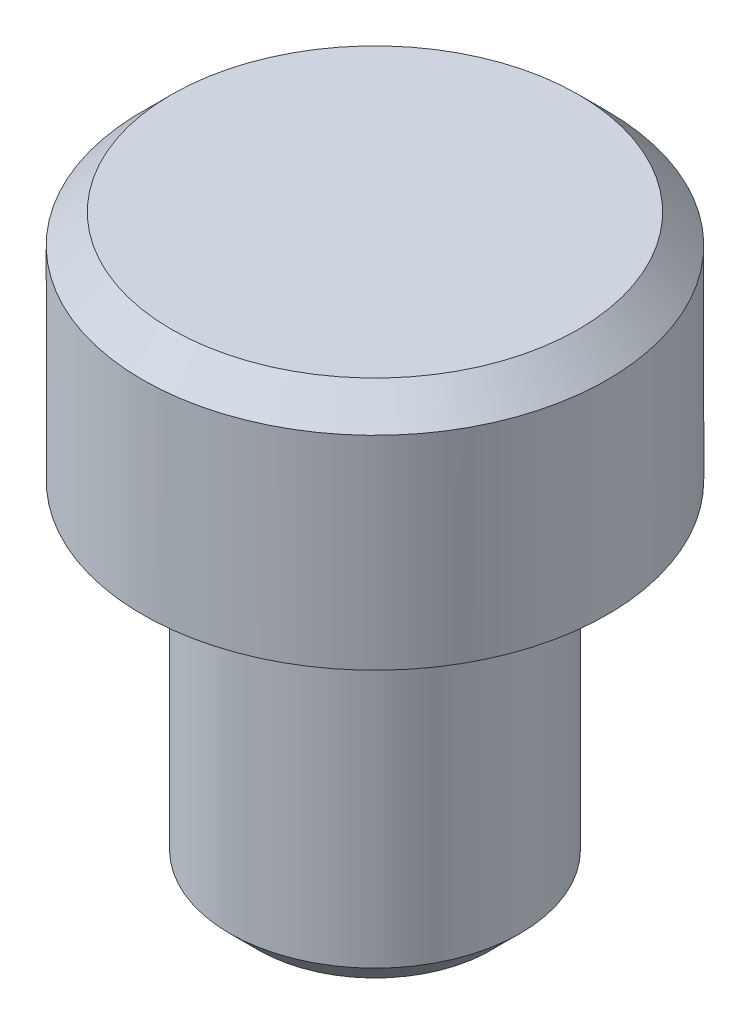
ISO-10303-21;
HEADER;
FILE_DESCRIPTION(('STEP AP214'),'2;1');
FILE_NAME('part.step','',(''),(''),'','','');
FILE_SCHEMA(('AUTOMOTIVE_DESIGN { 1 0 10303 214 1 1 1 1 }'));
ENDSEC;
DATA;
#1=APPLICATION_CONTEXT('core data for automotive mechanical design processes');
#2=APPLICATION_PROTOCOL_DEFINITION('international standard','automotive_design',2000,#1);
#3=PRODUCT_CONTEXT('',#1,'mechanical');
#4=PRODUCT('Part','Part','',(#3));
#5=PRODUCT_RELATED_PRODUCT_CATEGORY('part','',(#4));
#6=PRODUCT_DEFINITION_FORMATION('','',#4);
#7=PRODUCT_DEFINITION_CONTEXT('part definition',#1,'design');
#8=PRODUCT_DEFINITION('design','',#6,#7);
#9=PRODUCT_DEFINITION_SHAPE('','',#8);
#10=(LENGTH_UNIT() NAMED_UNIT(*) SI_UNIT(.MILLI.,.METRE.));
#11=(NAMED_UNIT(*) PLANE_ANGLE_UNIT() SI_UNIT($,.RADIAN.));
#12=(NAMED_UNIT(*) SI_UNIT($,.STERADIAN.) SOLID_ANGLE_UNIT());
#13=UNCERTAINTY_MEASURE_WITH_UNIT(LENGTH_MEASURE(1.E-05),#10,'distance_accuracy_value','');
#14=(GEOMETRIC_REPRESENTATION_CONTEXT(3) GLOBAL_UNCERTAINTY_ASSIGNED_CONTEXT((#13)) GLOBAL_UNIT_ASSIGNED_CONTEXT((#10,
#11,#12)) REPRESENTATION_CONTEXT('',''));
#15=CARTESIAN_POINT('',(0.,0.,0.));
#16=DIRECTION('',(0.,0.,1.));
#17=DIRECTION('',(1.,0.,0.));
#18=AXIS2_PLACEMENT_3D('',#15,#16,#17);
#19=CARTESIAN_POINT('',(0.,0.,0.));
#20=DIRECTION('',(0.,1.,0.));
#21=DIRECTION('',(0.,0.,1.));
#22=AXIS2_PLACEMENT_3D('',#19,#20,#21);
#23=PLANE('',#22);
#24=CARTESIAN_POINT('',(0.,0.,0.));
#25=DIRECTION('',(0.,1.,0.));
#26=DIRECTION('',(0.,0.,1.));
#27=AXIS2_PLACEMENT_3D('',#24,#25,#26);
#28=CIRCLE('',#27,6.99999999999999);
#29=CARTESIAN_POINT('',(0.,0.,6.99999999999999));
#30=VERTEX_POINT('',#29);
#31=EDGE_CURVE('E10',#30,#30,#28,.T.);
#32=ORIENTED_EDGE('',*,*,#31,.T.);
#33=EDGE_LOOP('',(#32));
#34=FACE_BOUND('',#33,.T.);
#35=ADVANCED_FACE('F32',(#34),#23,.T.);
#36=CARTESIAN_POINT('',(0.,-20.,0.));
#37=DIRECTION('',(0.,-1.,0.));
#38=DIRECTION('',(0.,0.,-1.));
#39=AXIS2_PLACEMENT_3D('',#36,#37,#38);
#40=CYLINDRICAL_SURFACE('',#39,8.);
#41=CARTESIAN_POINT('',(0.,-1.,0.));
#42=DIRECTION('',(0.,1.,0.));
#43=DIRECTION('',(0.,0.,1.));
#44=AXIS2_PLACEMENT_3D('',#41,#42,#43);
#45=CIRCLE('',#44,8.);
#46=CARTESIAN_POINT('',(0.,-1.,8.));
#47=VERTEX_POINT('',#46);
#48=EDGE_CURVE('E39',#47,#47,#45,.F.);
#49=ORIENTED_EDGE('',*,*,#48,.T.);
#50=EDGE_LOOP('',(#49));
#51=FACE_BOUND('',#50,.T.);
#52=CARTESIAN_POINT('',(0.,-8.,0.));
#53=DIRECTION('',(0.,-1.,0.));
#54=DIRECTION('',(0.,0.,-1.));
#55=AXIS2_PLACEMENT_3D('',#52,#53,#54);
#56=CIRCLE('',#55,8.);
#57=CARTESIAN_POINT('',(0.,-8.,-8.));
#58=VERTEX_POINT('',#57);
#59=EDGE_CURVE('E55',#58,#58,#56,.T.);
#60=ORIENTED_EDGE('',*,*,#59,.F.);
#61=EDGE_LOOP('',(#60));
#62=FACE_BOUND('',#61,.T.);
#63=ADVANCED_FACE('F80',(#51,#62),#40,.T.);
#64=CARTESIAN_POINT('',(8.,-8.,0.));
#65=DIRECTION('',(0.,-1.,0.));
#66=DIRECTION('',(0.,0.,-1.));
#67=AXIS2_PLACEMENT_3D('',#64,#65,#66);
#68=PLANE('',#67);
#69=ORIENTED_EDGE('',*,*,#59,.T.);
#70=EDGE_LOOP('',(#69));
#71=FACE_BOUND('',#70,.T.);
#72=CARTESIAN_POINT('',(0.,-8.,0.));
#73=DIRECTION('',(0.,-1.,0.));
#74=DIRECTION('',(0.,0.,-1.));
#75=AXIS2_PLACEMENT_3D('',#72,#73,#74);
#76=CIRCLE('',#75,4.);
#77=CARTESIAN_POINT('',(0.,-8.,-4.));
#78=VERTEX_POINT('',#77);
#79=EDGE_CURVE('E58',#78,#78,#76,.T.);
#80=ORIENTED_EDGE('',*,*,#79,.F.);
#81=EDGE_LOOP('',(#80));
#82=FACE_BOUND('',#81,.T.);
#83=ADVANCED_FACE('F70',(#71,#82),#68,.T.);
#84=CARTESIAN_POINT('',(0.,-20.,0.));
#85=DIRECTION('',(0.,-1.,0.));
#86=DIRECTION('',(0.,0.,-1.));
#87=AXIS2_PLACEMENT_3D('',#84,#85,#86);
#88=CYLINDRICAL_SURFACE('',#87,4.);
#89=ORIENTED_EDGE('',*,*,#79,.T.);
#90=EDGE_LOOP('',(#89));
#91=FACE_BOUND('',#90,.T.);
#92=CARTESIAN_POINT('',(0.,-9.,0.));
#93=DIRECTION('',(0.,-1.,0.));
#94=DIRECTION('',(0.,0.,-1.));
#95=AXIS2_PLACEMENT_3D('',#92,#93,#94);
#96=CIRCLE('',#95,4.);
#97=CARTESIAN_POINT('',(0.,-9.,-4.));
#98=VERTEX_POINT('',#97);
#99=EDGE_CURVE('E61',#98,#98,#96,.T.);
#100=ORIENTED_EDGE('',*,*,#99,.F.);
#101=EDGE_LOOP('',(#100));
#102=FACE_BOUND('',#101,.T.);
#103=ADVANCED_FACE('F67',(#91,#102),#88,.T.);
#104=CARTESIAN_POINT('',(0.,-20.,0.));
#105=DIRECTION('',(0.,-1.,0.));
#106=DIRECTION('',(0.,0.,-1.));
#107=AXIS2_PLACEMENT_3D('',#104,#105,#106);
#108=CYLINDRICAL_SURFACE('',#107,5.);
#109=CARTESIAN_POINT('',(0.,-19.,0.));
#110=DIRECTION('',(0.,-1.,0.));
#111=DIRECTION('',(0.,0.,-1.));
#112=AXIS2_PLACEMENT_3D('',#109,#110,#111);
#113=CIRCLE('',#112,5.);
#114=CARTESIAN_POINT('',(0.,-19.,-5.));
#115=VERTEX_POINT('',#114);
#116=EDGE_CURVE('E43',#115,#115,#113,.F.);
#117=ORIENTED_EDGE('',*,*,#116,.T.);
#118=EDGE_LOOP('',(#117));
#119=FACE_BOUND('',#118,.T.);
#120=CARTESIAN_POINT('',(0.,-10.,0.));
#121=DIRECTION('',(0.,1.,0.));
#122=DIRECTION('',(0.,0.,1.));
#123=AXIS2_PLACEMENT_3D('',#120,#121,#122);
#124=CIRCLE('',#123,5.);
#125=CARTESIAN_POINT('',(0.,-10.,5.));
#126=VERTEX_POINT('',#125);
#127=EDGE_CURVE('E47',#126,#126,#124,.F.);
#128=ORIENTED_EDGE('',*,*,#127,.T.);
#129=EDGE_LOOP('',(#128));
#130=FACE_BOUND('',#129,.T.);
#131=ADVANCED_FACE('F69',(#119,#130),#108,.T.);
#132=CARTESIAN_POINT('',(5.,-20.,0.));
#133=DIRECTION('',(0.,-1.,0.));
#134=DIRECTION('',(0.,0.,-1.));
#135=AXIS2_PLACEMENT_3D('',#132,#133,#134);
#136=PLANE('',#135);
#137=CARTESIAN_POINT('',(0.,-20.,0.));
#138=DIRECTION('',(0.,-1.,0.));
#139=DIRECTION('',(0.,0.,-1.));
#140=AXIS2_PLACEMENT_3D('',#137,#138,#139);
#141=CIRCLE('',#140,4.);
#142=CARTESIAN_POINT('',(0.,-20.,-4.));
#143=VERTEX_POINT('',#142);
#144=EDGE_CURVE('E52',#143,#143,#141,.T.);
#145=ORIENTED_EDGE('',*,*,#144,.T.);
#146=EDGE_LOOP('',(#145));
#147=FACE_BOUND('',#146,.T.);
#148=ADVANCED_FACE('F77',(#147),#136,.T.);
#149=CARTESIAN_POINT('',(0.,-20.,0.));
#150=DIRECTION('',(0.,1.,0.));
#151=DIRECTION('',(0.,0.,1.));
#152=AXIS2_PLACEMENT_3D('',#149,#150,#151);
#153=CONICAL_SURFACE('',#152,4.,0.785398163397447);
#154=ORIENTED_EDGE('',*,*,#116,.F.);
#155=EDGE_LOOP('',(#154));
#156=FACE_BOUND('',#155,.T.);
#157=ORIENTED_EDGE('',*,*,#144,.F.);
#158=EDGE_LOOP('',(#157));
#159=FACE_BOUND('',#158,.T.);
#160=ADVANCED_FACE('F90',(#156,#159),#153,.T.);
#161=CARTESIAN_POINT('',(0.,-1.,0.));
#162=DIRECTION('',(0.,-1.,0.));
#163=DIRECTION('',(0.,0.,-1.));
#164=AXIS2_PLACEMENT_3D('',#161,#162,#163);
#165=CONICAL_SURFACE('',#164,8.,0.78539816339745);
#166=ORIENTED_EDGE('',*,*,#31,.F.);
#167=EDGE_LOOP('',(#166));
#168=FACE_BOUND('',#167,.T.);
#169=ORIENTED_EDGE('',*,*,#48,.F.);
#170=EDGE_LOOP('',(#169));
#171=FACE_BOUND('',#170,.T.);
#172=ADVANCED_FACE('F92',(#168,#171),#165,.T.);
#173=CARTESIAN_POINT('',(0.,-10.,0.));
#174=DIRECTION('',(0.,-1.,0.));
#175=DIRECTION('',(0.,0.,-1.));
#176=AXIS2_PLACEMENT_3D('',#173,#174,#175);
#177=CONICAL_SURFACE('',#176,5.,0.785398163397452);
#178=ORIENTED_EDGE('',*,*,#99,.T.);
#179=EDGE_LOOP('',(#178));
#180=FACE_BOUND('',#179,.T.);
#181=ORIENTED_EDGE('',*,*,#127,.F.);
#182=EDGE_LOOP('',(#181));
#183=FACE_BOUND('',#182,.T.);
#184=ADVANCED_FACE('F34',(#180,#183),#177,.T.);
#185=CLOSED_SHELL('',(#35,#63,#83,#103,#131,#148,#160,#172,#184));
#186=MANIFOLD_SOLID_BREP('B2',#185);
#187=ADVANCED_BREP_SHAPE_REPRESENTATION('',(#18,#186),#14);
#188=SHAPE_DEFINITION_REPRESENTATION(#9,#187);
ENDSEC;
END-ISO-10303-21;
